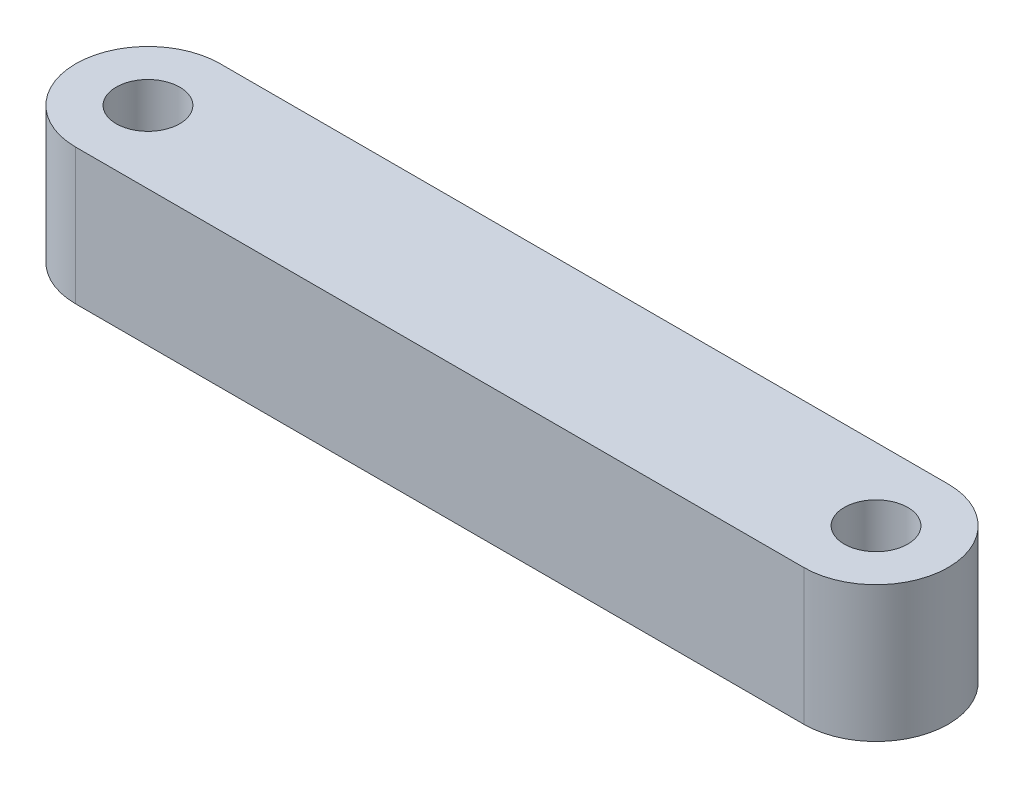
ISO-10303-21;
HEADER;
FILE_DESCRIPTION(('STEP AP214'),'2;1');
FILE_NAME('part.step','',(''),(''),'','','');
FILE_SCHEMA(('AUTOMOTIVE_DESIGN { 1 0 10303 214 1 1 1 1 }'));
ENDSEC;
DATA;
#1=APPLICATION_CONTEXT('core data for automotive mechanical design processes');
#2=APPLICATION_PROTOCOL_DEFINITION('international standard','automotive_design',2000,#1);
#3=PRODUCT_CONTEXT('',#1,'mechanical');
#4=PRODUCT('Part','Part','',(#3));
#5=PRODUCT_RELATED_PRODUCT_CATEGORY('part','',(#4));
#6=PRODUCT_DEFINITION_FORMATION('','',#4);
#7=PRODUCT_DEFINITION_CONTEXT('part definition',#1,'design');
#8=PRODUCT_DEFINITION('design','',#6,#7);
#9=PRODUCT_DEFINITION_SHAPE('','',#8);
#10=(LENGTH_UNIT() NAMED_UNIT(*) SI_UNIT(.MILLI.,.METRE.));
#11=(NAMED_UNIT(*) PLANE_ANGLE_UNIT() SI_UNIT($,.RADIAN.));
#12=(NAMED_UNIT(*) SI_UNIT($,.STERADIAN.) SOLID_ANGLE_UNIT());
#13=UNCERTAINTY_MEASURE_WITH_UNIT(LENGTH_MEASURE(1.E-05),#10,'distance_accuracy_value','');
#14=(GEOMETRIC_REPRESENTATION_CONTEXT(3) GLOBAL_UNCERTAINTY_ASSIGNED_CONTEXT((#13)) GLOBAL_UNIT_ASSIGNED_CONTEXT((#10,
#11,#12)) REPRESENTATION_CONTEXT('',''));
#15=CARTESIAN_POINT('',(0.,0.,0.));
#16=DIRECTION('',(0.,0.,1.));
#17=DIRECTION('',(1.,0.,0.));
#18=AXIS2_PLACEMENT_3D('',#15,#16,#17);
#19=CARTESIAN_POINT('',(-16.,5.969,0.));
#20=DIRECTION('',(0.,1.,0.));
#21=DIRECTION('',(0.,0.,1.));
#22=AXIS2_PLACEMENT_3D('',#19,#20,#21);
#23=PLANE('',#22);
#24=CARTESIAN_POINT('',(-16.,5.969,0.));
#25=DIRECTION('',(0.,1.,0.));
#26=DIRECTION('',(0.,0.,1.));
#27=AXIS2_PLACEMENT_3D('',#24,#25,#26);
#28=CIRCLE('',#27,1.397);
#29=CARTESIAN_POINT('',(-16.,5.969,1.397));
#30=VERTEX_POINT('',#29);
#31=EDGE_CURVE('E100',#30,#30,#28,.T.);
#32=ORIENTED_EDGE('',*,*,#31,.F.);
#33=EDGE_LOOP('',(#32));
#34=FACE_BOUND('',#33,.T.);
#35=CARTESIAN_POINT('',(-16.,5.969,0.));
#36=DIRECTION('',(0.,1.,0.));
#37=DIRECTION('',(0.,0.,1.));
#38=AXIS2_PLACEMENT_3D('',#35,#36,#37);
#39=CIRCLE('',#38,3.175);
#40=CARTESIAN_POINT('',(-16.,5.969,-3.175));
#41=VERTEX_POINT('',#40);
#42=CARTESIAN_POINT('',(-16.,5.969,3.175));
#43=VERTEX_POINT('',#42);
#44=EDGE_CURVE('E85',#41,#43,#39,.T.);
#45=ORIENTED_EDGE('',*,*,#44,.T.);
#46=DIRECTION('',(1.,0.,0.));
#47=VECTOR('',#46,1.);
#48=CARTESIAN_POINT('',(-16.,5.969,3.175));
#49=LINE('',#48,#47);
#50=CARTESIAN_POINT('',(16.,5.969,3.175));
#51=VERTEX_POINT('',#50);
#52=EDGE_CURVE('E80',#43,#51,#49,.T.);
#53=ORIENTED_EDGE('',*,*,#52,.T.);
#54=CARTESIAN_POINT('',(16.,5.969,0.));
#55=DIRECTION('',(0.,1.,0.));
#56=DIRECTION('',(0.,0.,1.));
#57=AXIS2_PLACEMENT_3D('',#54,#55,#56);
#58=CIRCLE('',#57,3.175);
#59=CARTESIAN_POINT('',(16.,5.969,-3.175));
#60=VERTEX_POINT('',#59);
#61=EDGE_CURVE('E83',#51,#60,#58,.T.);
#62=ORIENTED_EDGE('',*,*,#61,.T.);
#63=DIRECTION('',(-1.,0.,0.));
#64=VECTOR('',#63,1.);
#65=CARTESIAN_POINT('',(-16.,5.969,-3.175));
#66=LINE('',#65,#64);
#67=EDGE_CURVE('E50',#60,#41,#66,.T.);
#68=ORIENTED_EDGE('',*,*,#67,.T.);
#69=EDGE_LOOP('',(#45,#53,#62,#68));
#70=FACE_BOUND('',#69,.T.);
#71=CARTESIAN_POINT('',(16.,5.969,0.));
#72=DIRECTION('',(0.,1.,0.));
#73=DIRECTION('',(0.,0.,1.));
#74=AXIS2_PLACEMENT_3D('',#71,#72,#73);
#75=CIRCLE('',#74,1.397);
#76=CARTESIAN_POINT('',(16.,5.969,1.397));
#77=VERTEX_POINT('',#76);
#78=EDGE_CURVE('E115',#77,#77,#75,.T.);
#79=ORIENTED_EDGE('',*,*,#78,.F.);
#80=EDGE_LOOP('',(#79));
#81=FACE_BOUND('',#80,.T.);
#82=ADVANCED_FACE('F33',(#34,#70,#81),#23,.T.);
#83=CARTESIAN_POINT('',(-16.,0.,0.));
#84=DIRECTION('',(0.,1.,0.));
#85=DIRECTION('',(0.,0.,1.));
#86=AXIS2_PLACEMENT_3D('',#83,#84,#85);
#87=PLANE('',#86);
#88=CARTESIAN_POINT('',(-16.,0.,0.));
#89=DIRECTION('',(0.,1.,0.));
#90=DIRECTION('',(0.,0.,1.));
#91=AXIS2_PLACEMENT_3D('',#88,#89,#90);
#92=CIRCLE('',#91,1.397);
#93=CARTESIAN_POINT('',(-16.,0.,1.397));
#94=VERTEX_POINT('',#93);
#95=EDGE_CURVE('E112',#94,#94,#92,.T.);
#96=ORIENTED_EDGE('',*,*,#95,.T.);
#97=EDGE_LOOP('',(#96));
#98=FACE_BOUND('',#97,.T.);
#99=CARTESIAN_POINT('',(-16.,0.,0.));
#100=DIRECTION('',(0.,1.,0.));
#101=DIRECTION('',(0.,0.,1.));
#102=AXIS2_PLACEMENT_3D('',#99,#100,#101);
#103=CIRCLE('',#102,3.175);
#104=CARTESIAN_POINT('',(-16.,0.,-3.175));
#105=VERTEX_POINT('',#104);
#106=CARTESIAN_POINT('',(-16.,0.,3.175));
#107=VERTEX_POINT('',#106);
#108=EDGE_CURVE('E97',#105,#107,#103,.T.);
#109=ORIENTED_EDGE('',*,*,#108,.F.);
#110=DIRECTION('',(-1.,0.,0.));
#111=VECTOR('',#110,1.);
#112=CARTESIAN_POINT('',(-16.,0.,-3.175));
#113=LINE('',#112,#111);
#114=CARTESIAN_POINT('',(16.,0.,-3.175));
#115=VERTEX_POINT('',#114);
#116=EDGE_CURVE('E73',#115,#105,#113,.T.);
#117=ORIENTED_EDGE('',*,*,#116,.F.);
#118=CARTESIAN_POINT('',(16.,0.,0.));
#119=DIRECTION('',(0.,1.,0.));
#120=DIRECTION('',(0.,0.,1.));
#121=AXIS2_PLACEMENT_3D('',#118,#119,#120);
#122=CIRCLE('',#121,3.175);
#123=CARTESIAN_POINT('',(16.,0.,3.175));
#124=VERTEX_POINT('',#123);
#125=EDGE_CURVE('E67',#124,#115,#122,.T.);
#126=ORIENTED_EDGE('',*,*,#125,.F.);
#127=DIRECTION('',(1.,0.,0.));
#128=VECTOR('',#127,1.);
#129=CARTESIAN_POINT('',(-16.,0.,3.175));
#130=LINE('',#129,#128);
#131=EDGE_CURVE('E89',#107,#124,#130,.T.);
#132=ORIENTED_EDGE('',*,*,#131,.F.);
#133=EDGE_LOOP('',(#109,#117,#126,#132));
#134=FACE_BOUND('',#133,.T.);
#135=CARTESIAN_POINT('',(16.,0.,0.));
#136=DIRECTION('',(0.,1.,0.));
#137=DIRECTION('',(0.,0.,1.));
#138=AXIS2_PLACEMENT_3D('',#135,#136,#137);
#139=CIRCLE('',#138,1.397);
#140=CARTESIAN_POINT('',(16.,0.,1.397));
#141=VERTEX_POINT('',#140);
#142=EDGE_CURVE('E118',#141,#141,#139,.T.);
#143=ORIENTED_EDGE('',*,*,#142,.T.);
#144=EDGE_LOOP('',(#143));
#145=FACE_BOUND('',#144,.T.);
#146=ADVANCED_FACE('F108',(#98,#134,#145),#87,.F.);
#147=CARTESIAN_POINT('',(-16.,5.969,0.));
#148=DIRECTION('',(0.,-1.,0.));
#149=DIRECTION('',(0.,0.,-1.));
#150=AXIS2_PLACEMENT_3D('',#147,#148,#149);
#151=CYLINDRICAL_SURFACE('',#150,3.175);
#152=ORIENTED_EDGE('',*,*,#108,.T.);
#153=DIRECTION('',(0.,-1.,0.));
#154=VECTOR('',#153,1.);
#155=CARTESIAN_POINT('',(-16.,5.969,3.175));
#156=LINE('',#155,#154);
#157=EDGE_CURVE('E11',#43,#107,#156,.T.);
#158=ORIENTED_EDGE('',*,*,#157,.F.);
#159=ORIENTED_EDGE('',*,*,#44,.F.);
#160=DIRECTION('',(0.,-1.,0.));
#161=VECTOR('',#160,1.);
#162=CARTESIAN_POINT('',(-16.,5.969,-3.175));
#163=LINE('',#162,#161);
#164=EDGE_CURVE('E93',#41,#105,#163,.T.);
#165=ORIENTED_EDGE('',*,*,#164,.T.);
#166=EDGE_LOOP('',(#152,#158,#159,#165));
#167=FACE_BOUND('',#166,.T.);
#168=ADVANCED_FACE('F35',(#167),#151,.T.);
#169=CARTESIAN_POINT('',(-16.,5.969,3.175));
#170=DIRECTION('',(0.,0.,-1.));
#171=DIRECTION('',(-1.,0.,0.));
#172=AXIS2_PLACEMENT_3D('',#169,#170,#171);
#173=PLANE('',#172);
#174=ORIENTED_EDGE('',*,*,#131,.T.);
#175=DIRECTION('',(0.,-1.,0.));
#176=VECTOR('',#175,1.);
#177=CARTESIAN_POINT('',(16.,5.969,3.175));
#178=LINE('',#177,#176);
#179=EDGE_CURVE('E42',#51,#124,#178,.T.);
#180=ORIENTED_EDGE('',*,*,#179,.F.);
#181=ORIENTED_EDGE('',*,*,#52,.F.);
#182=ORIENTED_EDGE('',*,*,#157,.T.);
#183=EDGE_LOOP('',(#174,#180,#181,#182));
#184=FACE_BOUND('',#183,.T.);
#185=ADVANCED_FACE('F88',(#184),#173,.F.);
#186=CARTESIAN_POINT('',(16.,5.969,0.));
#187=DIRECTION('',(0.,-1.,0.));
#188=DIRECTION('',(0.,0.,-1.));
#189=AXIS2_PLACEMENT_3D('',#186,#187,#188);
#190=CYLINDRICAL_SURFACE('',#189,3.175);
#191=ORIENTED_EDGE('',*,*,#125,.T.);
#192=DIRECTION('',(0.,-1.,0.));
#193=VECTOR('',#192,1.);
#194=CARTESIAN_POINT('',(16.,5.969,-3.175));
#195=LINE('',#194,#193);
#196=EDGE_CURVE('E90',#60,#115,#195,.T.);
#197=ORIENTED_EDGE('',*,*,#196,.F.);
#198=ORIENTED_EDGE('',*,*,#61,.F.);
#199=ORIENTED_EDGE('',*,*,#179,.T.);
#200=EDGE_LOOP('',(#191,#197,#198,#199));
#201=FACE_BOUND('',#200,.T.);
#202=ADVANCED_FACE('F91',(#201),#190,.T.);
#203=CARTESIAN_POINT('',(-16.,5.969,-3.175));
#204=DIRECTION('',(0.,0.,1.));
#205=DIRECTION('',(1.,0.,0.));
#206=AXIS2_PLACEMENT_3D('',#203,#204,#205);
#207=PLANE('',#206);
#208=ORIENTED_EDGE('',*,*,#116,.T.);
#209=ORIENTED_EDGE('',*,*,#164,.F.);
#210=ORIENTED_EDGE('',*,*,#67,.F.);
#211=ORIENTED_EDGE('',*,*,#196,.T.);
#212=EDGE_LOOP('',(#208,#209,#210,#211));
#213=FACE_BOUND('',#212,.T.);
#214=ADVANCED_FACE('F105',(#213),#207,.F.);
#215=CARTESIAN_POINT('',(-16.,5.969,0.));
#216=DIRECTION('',(0.,-1.,0.));
#217=DIRECTION('',(0.,0.,-1.));
#218=AXIS2_PLACEMENT_3D('',#215,#216,#217);
#219=CYLINDRICAL_SURFACE('',#218,1.397);
#220=ORIENTED_EDGE('',*,*,#31,.T.);
#221=EDGE_LOOP('',(#220));
#222=FACE_BOUND('',#221,.T.);
#223=ORIENTED_EDGE('',*,*,#95,.F.);
#224=EDGE_LOOP('',(#223));
#225=FACE_BOUND('',#224,.T.);
#226=ADVANCED_FACE('F136',(#222,#225),#219,.F.);
#227=CARTESIAN_POINT('',(16.,5.969,0.));
#228=DIRECTION('',(0.,-1.,0.));
#229=DIRECTION('',(0.,0.,-1.));
#230=AXIS2_PLACEMENT_3D('',#227,#228,#229);
#231=CYLINDRICAL_SURFACE('',#230,1.397);
#232=ORIENTED_EDGE('',*,*,#78,.T.);
#233=EDGE_LOOP('',(#232));
#234=FACE_BOUND('',#233,.T.);
#235=ORIENTED_EDGE('',*,*,#142,.F.);
#236=EDGE_LOOP('',(#235));
#237=FACE_BOUND('',#236,.T.);
#238=ADVANCED_FACE('F124',(#234,#237),#231,.F.);
#239=CLOSED_SHELL('',(#82,#146,#168,#185,#202,#214,#226,#238));
#240=MANIFOLD_SOLID_BREP('B2',#239);
#241=ADVANCED_BREP_SHAPE_REPRESENTATION('',(#18,#240),#14);
#242=SHAPE_DEFINITION_REPRESENTATION(#9,#241);
ENDSEC;
END-ISO-10303-21;
